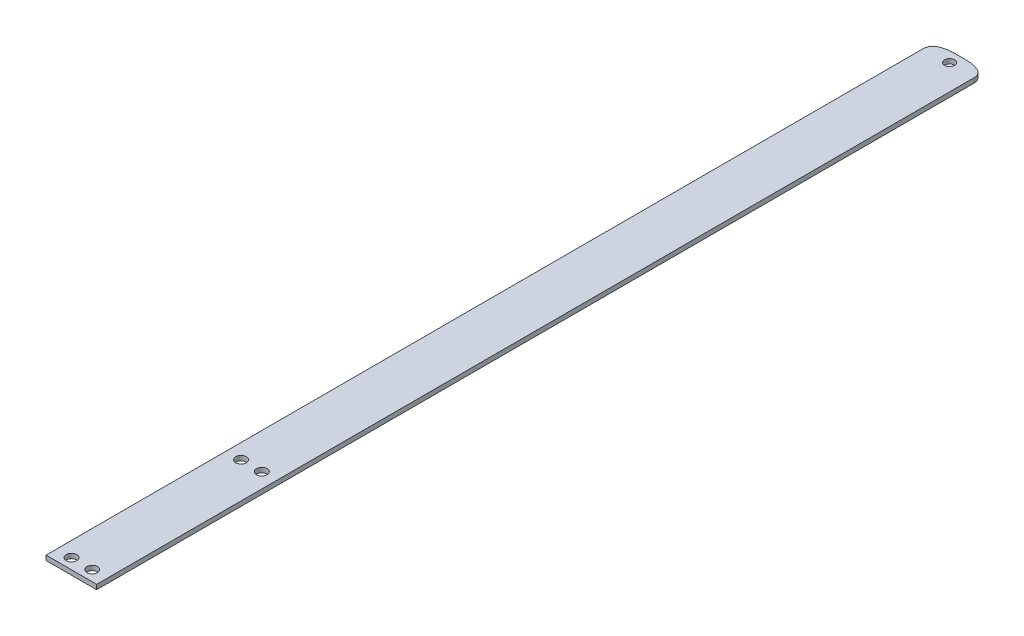
ISO-10303-21;
HEADER;
FILE_DESCRIPTION(('STEP AP214'),'2;1');
FILE_NAME('part.step','',(''),(''),'','','');
FILE_SCHEMA(('AUTOMOTIVE_DESIGN { 1 0 10303 214 1 1 1 1 }'));
ENDSEC;
DATA;
#1=APPLICATION_CONTEXT('core data for automotive mechanical design processes');
#2=APPLICATION_PROTOCOL_DEFINITION('international standard','automotive_design',2000,#1);
#3=PRODUCT_CONTEXT('',#1,'mechanical');
#4=PRODUCT('Part','Part','',(#3));
#5=PRODUCT_RELATED_PRODUCT_CATEGORY('part','',(#4));
#6=PRODUCT_DEFINITION_FORMATION('','',#4);
#7=PRODUCT_DEFINITION_CONTEXT('part definition',#1,'design');
#8=PRODUCT_DEFINITION('design','',#6,#7);
#9=PRODUCT_DEFINITION_SHAPE('','',#8);
#10=(LENGTH_UNIT() NAMED_UNIT(*) SI_UNIT(.MILLI.,.METRE.));
#11=(NAMED_UNIT(*) PLANE_ANGLE_UNIT() SI_UNIT($,.RADIAN.));
#12=(NAMED_UNIT(*) SI_UNIT($,.STERADIAN.) SOLID_ANGLE_UNIT());
#13=UNCERTAINTY_MEASURE_WITH_UNIT(LENGTH_MEASURE(1.E-05),#10,'distance_accuracy_value','');
#14=(GEOMETRIC_REPRESENTATION_CONTEXT(3) GLOBAL_UNCERTAINTY_ASSIGNED_CONTEXT((#13)) GLOBAL_UNIT_ASSIGNED_CONTEXT((#10,
#11,#12)) REPRESENTATION_CONTEXT('',''));
#15=CARTESIAN_POINT('',(0.,0.,0.));
#16=DIRECTION('',(0.,0.,1.));
#17=DIRECTION('',(1.,0.,0.));
#18=AXIS2_PLACEMENT_3D('',#15,#16,#17);
#19=CARTESIAN_POINT('',(-2.21653163902819E-13,125.794401912309,-307.135677028966));
#20=CARTESIAN_POINT('',(-3.52578728354851,125.794401912309,-307.326518028364));
#21=CARTESIAN_POINT('',(-6.34920000085502,125.794401912309,-306.916747924658));
#22=CARTESIAN_POINT('',(-8.47023815186009,125.794401912309,-305.906366717862));
#23=B_SPLINE_CURVE_WITH_KNOTS('',3,(#19,#20,#21,#22),.UNSPECIFIED.,.F.,.F.,(4,4),(0.,
0.308955344793494),.UNSPECIFIED.);
#24=DIRECTION('',(0.,-1.,0.));
#25=VECTOR('',#24,1.);
#26=SURFACE_OF_LINEAR_EXTRUSION('',#23,#25);
#27=CARTESIAN_POINT('',(-2.21653163902819E-13,123.794401912309,-307.135677028966));
#28=CARTESIAN_POINT('',(-3.52578728354851,123.794401912309,-307.326518028364));
#29=CARTESIAN_POINT('',(-6.34920000085502,123.794401912309,-306.916747924658));
#30=CARTESIAN_POINT('',(-8.47023815186009,123.794401912309,-305.906366717862));
#31=B_SPLINE_CURVE_WITH_KNOTS('',3,(#27,#28,#29,#30),.UNSPECIFIED.,.F.,.F.,(4,4),(0.,
0.308955344793494),.UNSPECIFIED.);
#32=CARTESIAN_POINT('',(-2.22044604925031E-13,123.794401912309,-307.135677028966));
#33=VERTEX_POINT('',#32);
#34=CARTESIAN_POINT('',(-8.47023815186012,123.794401912309,-305.906366717862));
#35=VERTEX_POINT('',#34);
#36=EDGE_CURVE('E216',#33,#35,#31,.T.);
#37=ORIENTED_EDGE('',*,*,#36,.T.);
#38=DIRECTION('',(0.,-1.,0.));
#39=VECTOR('',#38,1.);
#40=CARTESIAN_POINT('',(-8.47023815186012,125.794401912309,-305.906366717862));
#41=LINE('',#40,#39);
#42=CARTESIAN_POINT('',(-8.47023815186012,125.794401912309,-305.906366717862));
#43=VERTEX_POINT('',#42);
#44=EDGE_CURVE('E11',#43,#35,#41,.T.);
#45=ORIENTED_EDGE('',*,*,#44,.F.);
#46=CARTESIAN_POINT('',(-2.22044604925031E-13,125.794401912309,-307.135677028966));
#47=VERTEX_POINT('',#46);
#48=EDGE_CURVE('E84',#47,#43,#23,.T.);
#49=ORIENTED_EDGE('',*,*,#48,.F.);
#50=DIRECTION('',(0.,-1.,0.));
#51=VECTOR('',#50,1.);
#52=CARTESIAN_POINT('',(1.30812504025686E-13,125.794401912309,-307.135677028966));
#53=LINE('',#52,#51);
#54=EDGE_CURVE('E127',#47,#33,#53,.T.);
#55=ORIENTED_EDGE('',*,*,#54,.T.);
#56=EDGE_LOOP('',(#37,#45,#49,#55));
#57=FACE_BOUND('',#56,.T.);
#58=ADVANCED_FACE('F41',(#57),#26,.F.);
#59=CARTESIAN_POINT('',(-6.74999999999989,125.794401912309,-302.295164604869));
#60=DIRECTION('',(0.,-1.,0.));
#61=DIRECTION('',(0.,0.,-1.));
#62=AXIS2_PLACEMENT_3D('',#59,#60,#61);
#63=CYLINDRICAL_SURFACE('',#62,4.00000000000006);
#64=CARTESIAN_POINT('',(-6.74999999999989,123.794401912309,-302.295164604869));
#65=DIRECTION('',(0.,1.,0.));
#66=DIRECTION('',(0.,0.,1.));
#67=AXIS2_PLACEMENT_3D('',#64,#65,#66);
#68=CIRCLE('',#67,4.00000000000006);
#69=CARTESIAN_POINT('',(-10.75,123.794401912309,-302.295164604869));
#70=VERTEX_POINT('',#69);
#71=EDGE_CURVE('E222',#70,#35,#68,.F.);
#72=ORIENTED_EDGE('',*,*,#71,.F.);
#73=DIRECTION('',(0.,-1.,0.));
#74=VECTOR('',#73,1.);
#75=CARTESIAN_POINT('',(-10.75,125.794401912309,-302.295164604869));
#76=LINE('',#75,#74);
#77=CARTESIAN_POINT('',(-10.75,125.794401912309,-302.295164604869));
#78=VERTEX_POINT('',#77);
#79=EDGE_CURVE('E51',#78,#70,#76,.T.);
#80=ORIENTED_EDGE('',*,*,#79,.F.);
#81=CARTESIAN_POINT('',(-6.74999999999989,125.794401912309,-302.295164604869));
#82=DIRECTION('',(0.,1.,0.));
#83=DIRECTION('',(0.,0.,1.));
#84=AXIS2_PLACEMENT_3D('',#81,#82,#83);
#85=CIRCLE('',#84,4.00000000000006);
#86=EDGE_CURVE('E189',#78,#43,#85,.F.);
#87=ORIENTED_EDGE('',*,*,#86,.T.);
#88=ORIENTED_EDGE('',*,*,#44,.T.);
#89=EDGE_LOOP('',(#72,#80,#87,#88));
#90=FACE_BOUND('',#89,.T.);
#91=ADVANCED_FACE('F177',(#90),#63,.T.);
#92=CARTESIAN_POINT('',(-10.75,125.794401912309,0.));
#93=DIRECTION('',(-1.,0.,0.));
#94=DIRECTION('',(0.,0.,1.));
#95=AXIS2_PLACEMENT_3D('',#92,#93,#94);
#96=PLANE('',#95);
#97=DIRECTION('',(0.,0.,-1.));
#98=VECTOR('',#97,1.);
#99=CARTESIAN_POINT('',(-10.75,123.794401912309,0.));
#100=LINE('',#99,#98);
#101=CARTESIAN_POINT('',(-10.7499999999999,123.794401912309,70.3600000000001));
#102=VERTEX_POINT('',#101);
#103=EDGE_CURVE('E229',#102,#70,#100,.T.);
#104=ORIENTED_EDGE('',*,*,#103,.F.);
#105=DIRECTION('',(0.,-1.,0.));
#106=VECTOR('',#105,1.);
#107=CARTESIAN_POINT('',(-10.7499999999999,125.794401912309,70.3600000000001));
#108=LINE('',#107,#106);
#109=CARTESIAN_POINT('',(-10.7499999999999,125.794401912309,70.3600000000001));
#110=VERTEX_POINT('',#109);
#111=EDGE_CURVE('E59',#110,#102,#108,.T.);
#112=ORIENTED_EDGE('',*,*,#111,.F.);
#113=DIRECTION('',(0.,0.,-1.));
#114=VECTOR('',#113,1.);
#115=CARTESIAN_POINT('',(-10.75,125.794401912309,0.));
#116=LINE('',#115,#114);
#117=EDGE_CURVE('E198',#110,#78,#116,.T.);
#118=ORIENTED_EDGE('',*,*,#117,.T.);
#119=ORIENTED_EDGE('',*,*,#79,.T.);
#120=EDGE_LOOP('',(#104,#112,#118,#119));
#121=FACE_BOUND('',#120,.T.);
#122=ADVANCED_FACE('F174',(#121),#96,.T.);
#123=CARTESIAN_POINT('',(0.,125.794401912309,70.3600000000001));
#124=DIRECTION('',(0.,0.,-1.));
#125=DIRECTION('',(-1.,0.,0.));
#126=AXIS2_PLACEMENT_3D('',#123,#124,#125);
#127=PLANE('',#126);
#128=DIRECTION('',(1.,0.,0.));
#129=VECTOR('',#128,1.);
#130=CARTESIAN_POINT('',(0.,123.794401912309,70.3600000000001));
#131=LINE('',#130,#129);
#132=CARTESIAN_POINT('',(10.7499999999999,123.794401912309,70.3600000000001));
#133=VERTEX_POINT('',#132);
#134=EDGE_CURVE('E233',#102,#133,#131,.T.);
#135=ORIENTED_EDGE('',*,*,#134,.T.);
#136=DIRECTION('',(0.,-1.,0.));
#137=VECTOR('',#136,1.);
#138=CARTESIAN_POINT('',(10.7499999999999,125.794401912309,70.3600000000001));
#139=LINE('',#138,#137);
#140=CARTESIAN_POINT('',(10.7499999999999,125.794401912309,70.3600000000001));
#141=VERTEX_POINT('',#140);
#142=EDGE_CURVE('E251',#141,#133,#139,.T.);
#143=ORIENTED_EDGE('',*,*,#142,.F.);
#144=DIRECTION('',(1.,0.,0.));
#145=VECTOR('',#144,1.);
#146=CARTESIAN_POINT('',(0.,125.794401912309,70.3600000000001));
#147=LINE('',#146,#145);
#148=EDGE_CURVE('E201',#110,#141,#147,.T.);
#149=ORIENTED_EDGE('',*,*,#148,.F.);
#150=ORIENTED_EDGE('',*,*,#111,.T.);
#151=EDGE_LOOP('',(#135,#143,#149,#150));
#152=FACE_BOUND('',#151,.T.);
#153=ADVANCED_FACE('F170',(#152),#127,.F.);
#154=CARTESIAN_POINT('',(-4.40000000000019,125.794401912309,-6.13999999999987));
#155=DIRECTION('',(0.,-1.,0.));
#156=DIRECTION('',(0.,0.,-1.));
#157=AXIS2_PLACEMENT_3D('',#154,#155,#156);
#158=CYLINDRICAL_SURFACE('',#157,2.25);
#159=CARTESIAN_POINT('',(-4.40000000000019,125.794401912309,-6.13999999999987));
#160=DIRECTION('',(0.,1.,0.));
#161=DIRECTION('',(0.,0.,1.));
#162=AXIS2_PLACEMENT_3D('',#159,#160,#161);
#163=CIRCLE('',#162,2.25);
#164=CARTESIAN_POINT('',(-4.40000000000019,125.794401912309,-3.88999999999987));
#165=VERTEX_POINT('',#164);
#166=EDGE_CURVE('E190',#165,#165,#163,.T.);
#167=ORIENTED_EDGE('',*,*,#166,.T.);
#168=EDGE_LOOP('',(#167));
#169=FACE_BOUND('',#168,.T.);
#170=CARTESIAN_POINT('',(-4.40000000000019,123.794401912309,-6.13999999999987));
#171=DIRECTION('',(0.,1.,0.));
#172=DIRECTION('',(0.,0.,1.));
#173=AXIS2_PLACEMENT_3D('',#170,#171,#172);
#174=CIRCLE('',#173,2.25);
#175=CARTESIAN_POINT('',(-4.40000000000019,123.794401912309,-3.88999999999987));
#176=VERTEX_POINT('',#175);
#177=EDGE_CURVE('E212',#176,#176,#174,.T.);
#178=ORIENTED_EDGE('',*,*,#177,.F.);
#179=EDGE_LOOP('',(#178));
#180=FACE_BOUND('',#179,.T.);
#181=ADVANCED_FACE('F173',(#169,#180),#158,.F.);
#182=CARTESIAN_POINT('',(-4.40000000000019,125.794401912309,65.8600000000001));
#183=DIRECTION('',(0.,-1.,0.));
#184=DIRECTION('',(0.,0.,-1.));
#185=AXIS2_PLACEMENT_3D('',#182,#183,#184);
#186=CYLINDRICAL_SURFACE('',#185,2.25);
#187=CARTESIAN_POINT('',(-4.40000000000019,125.794401912309,65.8600000000001));
#188=DIRECTION('',(0.,1.,0.));
#189=DIRECTION('',(0.,0.,1.));
#190=AXIS2_PLACEMENT_3D('',#187,#188,#189);
#191=CIRCLE('',#190,2.25);
#192=CARTESIAN_POINT('',(-4.40000000000019,125.794401912309,68.1100000000001));
#193=VERTEX_POINT('',#192);
#194=EDGE_CURVE('E240',#193,#193,#191,.T.);
#195=ORIENTED_EDGE('',*,*,#194,.T.);
#196=EDGE_LOOP('',(#195));
#197=FACE_BOUND('',#196,.T.);
#198=CARTESIAN_POINT('',(-4.40000000000019,123.794401912309,65.8600000000001));
#199=DIRECTION('',(0.,1.,0.));
#200=DIRECTION('',(0.,0.,1.));
#201=AXIS2_PLACEMENT_3D('',#198,#199,#200);
#202=CIRCLE('',#201,2.25);
#203=CARTESIAN_POINT('',(-4.40000000000019,123.794401912309,68.1100000000001));
#204=VERTEX_POINT('',#203);
#205=EDGE_CURVE('E208',#204,#204,#202,.T.);
#206=ORIENTED_EDGE('',*,*,#205,.F.);
#207=EDGE_LOOP('',(#206));
#208=FACE_BOUND('',#207,.T.);
#209=ADVANCED_FACE('F43',(#197,#208),#186,.F.);
#210=CARTESIAN_POINT('',(-2.20309881449055E-13,125.794401912309,-302.64));
#211=DIRECTION('',(0.,-1.,0.));
#212=DIRECTION('',(0.,0.,-1.));
#213=AXIS2_PLACEMENT_3D('',#210,#211,#212);
#214=CYLINDRICAL_SURFACE('',#213,2.09999999999999);
#215=CARTESIAN_POINT('',(-2.20309881449055E-13,123.794401912309,-302.64));
#216=DIRECTION('',(0.,1.,0.));
#217=DIRECTION('',(0.,0.,1.));
#218=AXIS2_PLACEMENT_3D('',#215,#216,#217);
#219=CIRCLE('',#218,2.09999999999999);
#220=CARTESIAN_POINT('',(-2.20309881449055E-13,123.794401912309,-300.54));
#221=VERTEX_POINT('',#220);
#222=EDGE_CURVE('E236',#221,#221,#219,.T.);
#223=ORIENTED_EDGE('',*,*,#222,.F.);
#224=EDGE_LOOP('',(#223));
#225=FACE_BOUND('',#224,.T.);
#226=CARTESIAN_POINT('',(-2.20309881449055E-13,125.794401912309,-302.64));
#227=DIRECTION('',(0.,1.,0.));
#228=DIRECTION('',(0.,0.,1.));
#229=AXIS2_PLACEMENT_3D('',#226,#227,#228);
#230=CIRCLE('',#229,2.09999999999999);
#231=CARTESIAN_POINT('',(-2.20309881449055E-13,125.794401912309,-300.54));
#232=VERTEX_POINT('',#231);
#233=EDGE_CURVE('E204',#232,#232,#230,.T.);
#234=ORIENTED_EDGE('',*,*,#233,.T.);
#235=EDGE_LOOP('',(#234));
#236=FACE_BOUND('',#235,.T.);
#237=ADVANCED_FACE('F163',(#225,#236),#214,.F.);
#238=CARTESIAN_POINT('',(0.,125.794401912309,0.));
#239=DIRECTION('',(0.,1.,0.));
#240=DIRECTION('',(0.,0.,1.));
#241=AXIS2_PLACEMENT_3D('',#238,#239,#240);
#242=PLANE('',#241);
#243=CARTESIAN_POINT('',(1.30421063003473E-13,125.794401912309,-307.135677028966));
#244=CARTESIAN_POINT('',(3.52578728354842,125.794401912309,-307.326518028364));
#245=CARTESIAN_POINT('',(6.34920000085493,125.794401912309,-306.916747924658));
#246=CARTESIAN_POINT('',(8.47023815186,125.794401912309,-305.906366717862));
#247=B_SPLINE_CURVE_WITH_KNOTS('',3,(#243,#244,#245,#246),.UNSPECIFIED.,.F.,.F.,(4,4),(0.,
0.308955344793494),.UNSPECIFIED.);
#248=CARTESIAN_POINT('',(8.47023815186003,125.794401912309,-305.906366717862));
#249=VERTEX_POINT('',#248);
#250=EDGE_CURVE('E109',#47,#249,#247,.T.);
#251=ORIENTED_EDGE('',*,*,#250,.F.);
#252=ORIENTED_EDGE('',*,*,#48,.T.);
#253=ORIENTED_EDGE('',*,*,#86,.F.);
#254=ORIENTED_EDGE('',*,*,#117,.F.);
#255=ORIENTED_EDGE('',*,*,#148,.T.);
#256=DIRECTION('',(0.,0.,-1.));
#257=VECTOR('',#256,1.);
#258=CARTESIAN_POINT('',(10.75,125.794401912309,0.));
#259=LINE('',#258,#257);
#260=CARTESIAN_POINT('',(10.7499999999999,125.794401912309,-302.295164604869));
#261=VERTEX_POINT('',#260);
#262=EDGE_CURVE('E112',#141,#261,#259,.T.);
#263=ORIENTED_EDGE('',*,*,#262,.T.);
#264=CARTESIAN_POINT('',(6.7499999999998,125.794401912309,-302.295164604869));
#265=DIRECTION('',(0.,-1.,0.));
#266=DIRECTION('',(0.,0.,1.));
#267=AXIS2_PLACEMENT_3D('',#264,#265,#266);
#268=CIRCLE('',#267,4.00000000000006);
#269=EDGE_CURVE('E104',#261,#249,#268,.F.);
#270=ORIENTED_EDGE('',*,*,#269,.T.);
#271=EDGE_LOOP('',(#251,#252,#253,#254,#255,#263,#270));
#272=FACE_BOUND('',#271,.T.);
#273=ORIENTED_EDGE('',*,*,#194,.F.);
#274=EDGE_LOOP('',(#273));
#275=FACE_BOUND('',#274,.T.);
#276=ORIENTED_EDGE('',*,*,#166,.F.);
#277=EDGE_LOOP('',(#276));
#278=FACE_BOUND('',#277,.T.);
#279=ORIENTED_EDGE('',*,*,#233,.F.);
#280=EDGE_LOOP('',(#279));
#281=FACE_BOUND('',#280,.T.);
#282=CARTESIAN_POINT('',(4.40000000000021,125.794401912309,65.8600000000001));
#283=DIRECTION('',(0.,-1.,0.));
#284=DIRECTION('',(0.,0.,1.));
#285=AXIS2_PLACEMENT_3D('',#282,#283,#284);
#286=CIRCLE('',#285,2.25);
#287=CARTESIAN_POINT('',(4.40000000000021,125.794401912309,68.1100000000001));
#288=VERTEX_POINT('',#287);
#289=EDGE_CURVE('E136',#288,#288,#286,.T.);
#290=ORIENTED_EDGE('',*,*,#289,.T.);
#291=EDGE_LOOP('',(#290));
#292=FACE_BOUND('',#291,.T.);
#293=CARTESIAN_POINT('',(4.40000000000018,125.794401912309,-6.13999999999987));
#294=DIRECTION('',(0.,-1.,0.));
#295=DIRECTION('',(0.,0.,1.));
#296=AXIS2_PLACEMENT_3D('',#293,#294,#295);
#297=CIRCLE('',#296,2.25);
#298=CARTESIAN_POINT('',(4.40000000000019,125.794401912309,-3.88999999999987));
#299=VERTEX_POINT('',#298);
#300=EDGE_CURVE('E132',#299,#299,#297,.T.);
#301=ORIENTED_EDGE('',*,*,#300,.T.);
#302=EDGE_LOOP('',(#301));
#303=FACE_BOUND('',#302,.T.);
#304=ADVANCED_FACE('F106',(#272,#275,#278,#281,#292,#303),#242,.T.);
#305=CARTESIAN_POINT('',(0.,123.794401912309,0.));
#306=DIRECTION('',(0.,1.,0.));
#307=DIRECTION('',(0.,0.,1.));
#308=AXIS2_PLACEMENT_3D('',#305,#306,#307);
#309=PLANE('',#308);
#310=ORIENTED_EDGE('',*,*,#36,.F.);
#311=CARTESIAN_POINT('',(1.30421063003473E-13,123.794401912309,-307.135677028966));
#312=CARTESIAN_POINT('',(3.52578728354842,123.794401912309,-307.326518028364));
#313=CARTESIAN_POINT('',(6.34920000085493,123.794401912309,-306.916747924658));
#314=CARTESIAN_POINT('',(8.47023815186,123.794401912309,-305.906366717862));
#315=B_SPLINE_CURVE_WITH_KNOTS('',3,(#311,#312,#313,#314),.UNSPECIFIED.,.F.,.F.,(4,4),(0.,
0.308955344793494),.UNSPECIFIED.);
#316=CARTESIAN_POINT('',(8.47023815186003,123.794401912309,-305.906366717862));
#317=VERTEX_POINT('',#316);
#318=EDGE_CURVE('E265',#33,#317,#315,.T.);
#319=ORIENTED_EDGE('',*,*,#318,.T.);
#320=CARTESIAN_POINT('',(6.7499999999998,123.794401912309,-302.295164604869));
#321=DIRECTION('',(0.,-1.,0.));
#322=DIRECTION('',(0.,0.,1.));
#323=AXIS2_PLACEMENT_3D('',#320,#321,#322);
#324=CIRCLE('',#323,4.00000000000006);
#325=CARTESIAN_POINT('',(10.7499999999999,123.794401912309,-302.295164604869));
#326=VERTEX_POINT('',#325);
#327=EDGE_CURVE('E122',#326,#317,#324,.F.);
#328=ORIENTED_EDGE('',*,*,#327,.F.);
#329=DIRECTION('',(0.,0.,-1.));
#330=VECTOR('',#329,1.);
#331=CARTESIAN_POINT('',(10.75,123.794401912309,0.));
#332=LINE('',#331,#330);
#333=EDGE_CURVE('E275',#133,#326,#332,.T.);
#334=ORIENTED_EDGE('',*,*,#333,.F.);
#335=ORIENTED_EDGE('',*,*,#134,.F.);
#336=ORIENTED_EDGE('',*,*,#103,.T.);
#337=ORIENTED_EDGE('',*,*,#71,.T.);
#338=EDGE_LOOP('',(#310,#319,#328,#334,#335,#336,#337));
#339=FACE_BOUND('',#338,.T.);
#340=ORIENTED_EDGE('',*,*,#205,.T.);
#341=EDGE_LOOP('',(#340));
#342=FACE_BOUND('',#341,.T.);
#343=ORIENTED_EDGE('',*,*,#177,.T.);
#344=EDGE_LOOP('',(#343));
#345=FACE_BOUND('',#344,.T.);
#346=ORIENTED_EDGE('',*,*,#222,.T.);
#347=EDGE_LOOP('',(#346));
#348=FACE_BOUND('',#347,.T.);
#349=CARTESIAN_POINT('',(4.40000000000021,123.794401912309,65.8600000000001));
#350=DIRECTION('',(0.,-1.,0.));
#351=DIRECTION('',(0.,0.,1.));
#352=AXIS2_PLACEMENT_3D('',#349,#350,#351);
#353=CIRCLE('',#352,2.25);
#354=CARTESIAN_POINT('',(4.40000000000021,123.794401912309,68.1100000000001));
#355=VERTEX_POINT('',#354);
#356=EDGE_CURVE('E257',#355,#355,#353,.T.);
#357=ORIENTED_EDGE('',*,*,#356,.F.);
#358=EDGE_LOOP('',(#357));
#359=FACE_BOUND('',#358,.T.);
#360=CARTESIAN_POINT('',(4.40000000000018,123.794401912309,-6.13999999999987));
#361=DIRECTION('',(0.,-1.,0.));
#362=DIRECTION('',(0.,0.,1.));
#363=AXIS2_PLACEMENT_3D('',#360,#361,#362);
#364=CIRCLE('',#363,2.25);
#365=CARTESIAN_POINT('',(4.40000000000019,123.794401912309,-3.88999999999987));
#366=VERTEX_POINT('',#365);
#367=EDGE_CURVE('E261',#366,#366,#364,.T.);
#368=ORIENTED_EDGE('',*,*,#367,.F.);
#369=EDGE_LOOP('',(#368));
#370=FACE_BOUND('',#369,.T.);
#371=ADVANCED_FACE('F150',(#339,#342,#345,#348,#359,#370),#309,.F.);
#372=DIRECTION('',(0.,-1.,0.));
#373=VECTOR('',#372,1.);
#374=SURFACE_OF_LINEAR_EXTRUSION('',#247,#373);
#375=ORIENTED_EDGE('',*,*,#318,.F.);
#376=ORIENTED_EDGE('',*,*,#54,.F.);
#377=ORIENTED_EDGE('',*,*,#250,.T.);
#378=DIRECTION('',(0.,-1.,0.));
#379=VECTOR('',#378,1.);
#380=CARTESIAN_POINT('',(8.47023815186003,125.794401912309,-305.906366717862));
#381=LINE('',#380,#379);
#382=EDGE_CURVE('E119',#249,#317,#381,.T.);
#383=ORIENTED_EDGE('',*,*,#382,.T.);
#384=EDGE_LOOP('',(#375,#376,#377,#383));
#385=FACE_BOUND('',#384,.T.);
#386=ADVANCED_FACE('F130',(#385),#374,.T.);
#387=CARTESIAN_POINT('',(6.7499999999998,125.794401912309,-302.295164604869));
#388=DIRECTION('',(0.,-1.,0.));
#389=DIRECTION('',(0.,0.,-1.));
#390=AXIS2_PLACEMENT_3D('',#387,#388,#389);
#391=CYLINDRICAL_SURFACE('',#390,4.00000000000006);
#392=ORIENTED_EDGE('',*,*,#327,.T.);
#393=ORIENTED_EDGE('',*,*,#382,.F.);
#394=ORIENTED_EDGE('',*,*,#269,.F.);
#395=DIRECTION('',(0.,-1.,0.));
#396=VECTOR('',#395,1.);
#397=CARTESIAN_POINT('',(10.7499999999999,125.794401912309,-302.295164604869));
#398=LINE('',#397,#396);
#399=EDGE_CURVE('E128',#261,#326,#398,.T.);
#400=ORIENTED_EDGE('',*,*,#399,.T.);
#401=EDGE_LOOP('',(#392,#393,#394,#400));
#402=FACE_BOUND('',#401,.T.);
#403=ADVANCED_FACE('F120',(#402),#391,.T.);
#404=CARTESIAN_POINT('',(10.75,125.794401912309,0.));
#405=DIRECTION('',(1.,0.,0.));
#406=DIRECTION('',(0.,0.,1.));
#407=AXIS2_PLACEMENT_3D('',#404,#405,#406);
#408=PLANE('',#407);
#409=ORIENTED_EDGE('',*,*,#333,.T.);
#410=ORIENTED_EDGE('',*,*,#399,.F.);
#411=ORIENTED_EDGE('',*,*,#262,.F.);
#412=ORIENTED_EDGE('',*,*,#142,.T.);
#413=EDGE_LOOP('',(#409,#410,#411,#412));
#414=FACE_BOUND('',#413,.T.);
#415=ADVANCED_FACE('F156',(#414),#408,.T.);
#416=CARTESIAN_POINT('',(4.40000000000018,125.794401912309,-6.13999999999987));
#417=DIRECTION('',(0.,-1.,0.));
#418=DIRECTION('',(0.,0.,-1.));
#419=AXIS2_PLACEMENT_3D('',#416,#417,#418);
#420=CYLINDRICAL_SURFACE('',#419,2.25);
#421=ORIENTED_EDGE('',*,*,#300,.F.);
#422=EDGE_LOOP('',(#421));
#423=FACE_BOUND('',#422,.T.);
#424=ORIENTED_EDGE('',*,*,#367,.T.);
#425=EDGE_LOOP('',(#424));
#426=FACE_BOUND('',#425,.T.);
#427=ADVANCED_FACE('F152',(#423,#426),#420,.F.);
#428=CARTESIAN_POINT('',(4.40000000000021,125.794401912309,65.8600000000001));
#429=DIRECTION('',(0.,-1.,0.));
#430=DIRECTION('',(0.,0.,-1.));
#431=AXIS2_PLACEMENT_3D('',#428,#429,#430);
#432=CYLINDRICAL_SURFACE('',#431,2.25);
#433=ORIENTED_EDGE('',*,*,#289,.F.);
#434=EDGE_LOOP('',(#433));
#435=FACE_BOUND('',#434,.T.);
#436=ORIENTED_EDGE('',*,*,#356,.T.);
#437=EDGE_LOOP('',(#436));
#438=FACE_BOUND('',#437,.T.);
#439=ADVANCED_FACE('F155',(#435,#438),#432,.F.);
#440=CLOSED_SHELL('',(#58,#91,#122,#153,#181,#209,#237,#304,#371,#386,#403,#415,#427,#439));
#441=MANIFOLD_SOLID_BREP('B2',#440);
#442=ADVANCED_BREP_SHAPE_REPRESENTATION('',(#18,#441),#14);
#443=SHAPE_DEFINITION_REPRESENTATION(#9,#442);
ENDSEC;
END-ISO-10303-21;
